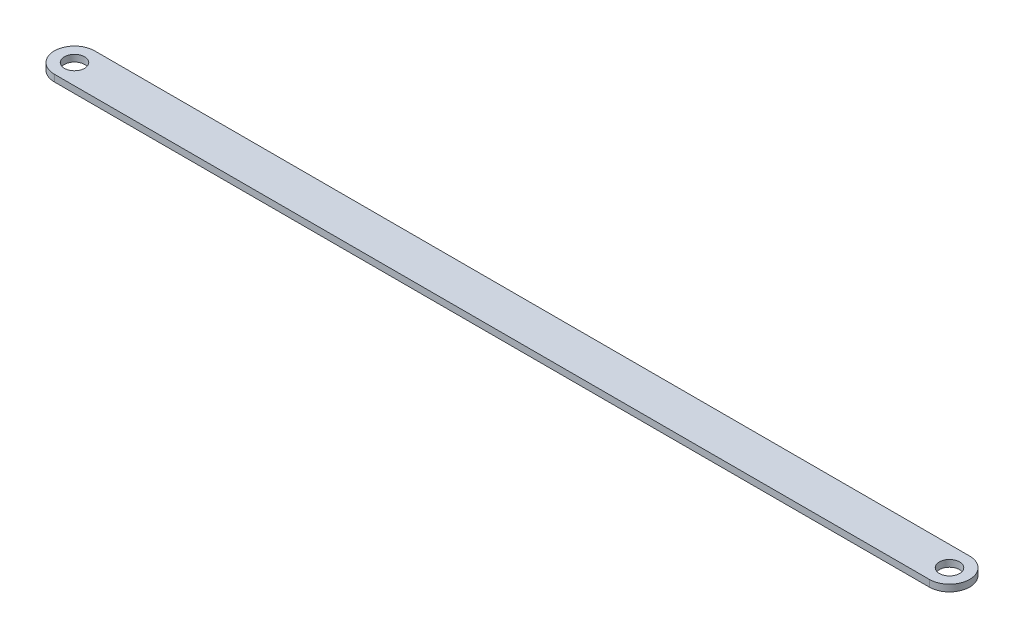
ISO-10303-21;
HEADER;
FILE_DESCRIPTION(('STEP AP214'),'2;1');
FILE_NAME('part.step','',(''),(''),'','','');
FILE_SCHEMA(('AUTOMOTIVE_DESIGN { 1 0 10303 214 1 1 1 1 }'));
ENDSEC;
DATA;
#1=APPLICATION_CONTEXT('core data for automotive mechanical design processes');
#2=APPLICATION_PROTOCOL_DEFINITION('international standard','automotive_design',2000,#1);
#3=PRODUCT_CONTEXT('',#1,'mechanical');
#4=PRODUCT('Part','Part','',(#3));
#5=PRODUCT_RELATED_PRODUCT_CATEGORY('part','',(#4));
#6=PRODUCT_DEFINITION_FORMATION('','',#4);
#7=PRODUCT_DEFINITION_CONTEXT('part definition',#1,'design');
#8=PRODUCT_DEFINITION('design','',#6,#7);
#9=PRODUCT_DEFINITION_SHAPE('','',#8);
#10=(LENGTH_UNIT() NAMED_UNIT(*) SI_UNIT(.MILLI.,.METRE.));
#11=(NAMED_UNIT(*) PLANE_ANGLE_UNIT() SI_UNIT($,.RADIAN.));
#12=(NAMED_UNIT(*) SI_UNIT($,.STERADIAN.) SOLID_ANGLE_UNIT());
#13=UNCERTAINTY_MEASURE_WITH_UNIT(LENGTH_MEASURE(1.E-05),#10,'distance_accuracy_value','');
#14=(GEOMETRIC_REPRESENTATION_CONTEXT(3) GLOBAL_UNCERTAINTY_ASSIGNED_CONTEXT((#13)) GLOBAL_UNIT_ASSIGNED_CONTEXT((#10,
#11,#12)) REPRESENTATION_CONTEXT('',''));
#15=CARTESIAN_POINT('',(0.,0.,0.));
#16=DIRECTION('',(0.,0.,1.));
#17=DIRECTION('',(1.,0.,0.));
#18=AXIS2_PLACEMENT_3D('',#15,#16,#17);
#19=CARTESIAN_POINT('',(65.,1.,0.));
#20=DIRECTION('',(0.,1.,0.));
#21=DIRECTION('',(0.,0.,1.));
#22=AXIS2_PLACEMENT_3D('',#19,#20,#21);
#23=PLANE('',#22);
#24=CARTESIAN_POINT('',(-65.,1.,0.));
#25=DIRECTION('',(0.,1.,0.));
#26=DIRECTION('',(0.,0.,1.));
#27=AXIS2_PLACEMENT_3D('',#24,#25,#26);
#28=CIRCLE('',#27,1.5);
#29=CARTESIAN_POINT('',(-65.,1.,1.5));
#30=VERTEX_POINT('',#29);
#31=EDGE_CURVE('E99',#30,#30,#28,.T.);
#32=ORIENTED_EDGE('',*,*,#31,.F.);
#33=EDGE_LOOP('',(#32));
#34=FACE_BOUND('',#33,.T.);
#35=CARTESIAN_POINT('',(65.,1.,0.));
#36=DIRECTION('',(0.,1.,0.));
#37=DIRECTION('',(0.,0.,1.));
#38=AXIS2_PLACEMENT_3D('',#35,#36,#37);
#39=CIRCLE('',#38,2.99999999999998);
#40=CARTESIAN_POINT('',(65.,1.,2.99999999999995));
#41=VERTEX_POINT('',#40);
#42=CARTESIAN_POINT('',(65.,1.,-3.));
#43=VERTEX_POINT('',#42);
#44=EDGE_CURVE('E84',#41,#43,#39,.T.);
#45=ORIENTED_EDGE('',*,*,#44,.T.);
#46=DIRECTION('',(-1.,0.,0.));
#47=VECTOR('',#46,1.);
#48=CARTESIAN_POINT('',(65.,1.,-3.));
#49=LINE('',#48,#47);
#50=CARTESIAN_POINT('',(-65.,1.,-2.99999999999998));
#51=VERTEX_POINT('',#50);
#52=EDGE_CURVE('E79',#43,#51,#49,.T.);
#53=ORIENTED_EDGE('',*,*,#52,.T.);
#54=CARTESIAN_POINT('',(-65.,1.,0.));
#55=DIRECTION('',(0.,1.,0.));
#56=DIRECTION('',(0.,0.,1.));
#57=AXIS2_PLACEMENT_3D('',#54,#55,#56);
#58=CIRCLE('',#57,2.99999999999998);
#59=CARTESIAN_POINT('',(-65.,1.,2.99999999999999));
#60=VERTEX_POINT('',#59);
#61=EDGE_CURVE('E82',#51,#60,#58,.T.);
#62=ORIENTED_EDGE('',*,*,#61,.T.);
#63=DIRECTION('',(1.,0.,0.));
#64=VECTOR('',#63,1.);
#65=CARTESIAN_POINT('',(65.,1.,2.99999999999995));
#66=LINE('',#65,#64);
#67=EDGE_CURVE('E49',#60,#41,#66,.T.);
#68=ORIENTED_EDGE('',*,*,#67,.T.);
#69=EDGE_LOOP('',(#45,#53,#62,#68));
#70=FACE_BOUND('',#69,.T.);
#71=CARTESIAN_POINT('',(65.,1.,0.));
#72=DIRECTION('',(0.,1.,0.));
#73=DIRECTION('',(0.,0.,1.));
#74=AXIS2_PLACEMENT_3D('',#71,#72,#73);
#75=CIRCLE('',#74,1.5);
#76=CARTESIAN_POINT('',(65.,1.,1.5));
#77=VERTEX_POINT('',#76);
#78=EDGE_CURVE('E114',#77,#77,#75,.T.);
#79=ORIENTED_EDGE('',*,*,#78,.F.);
#80=EDGE_LOOP('',(#79));
#81=FACE_BOUND('',#80,.T.);
#82=ADVANCED_FACE('F32',(#34,#70,#81),#23,.T.);
#83=CARTESIAN_POINT('',(65.,0.,0.));
#84=DIRECTION('',(0.,1.,0.));
#85=DIRECTION('',(0.,0.,1.));
#86=AXIS2_PLACEMENT_3D('',#83,#84,#85);
#87=PLANE('',#86);
#88=CARTESIAN_POINT('',(65.,0.,0.));
#89=DIRECTION('',(0.,1.,0.));
#90=DIRECTION('',(0.,0.,1.));
#91=AXIS2_PLACEMENT_3D('',#88,#89,#90);
#92=CIRCLE('',#91,2.99999999999998);
#93=CARTESIAN_POINT('',(65.,0.,2.99999999999995));
#94=VERTEX_POINT('',#93);
#95=CARTESIAN_POINT('',(65.,0.,-3.));
#96=VERTEX_POINT('',#95);
#97=EDGE_CURVE('E96',#94,#96,#92,.T.);
#98=ORIENTED_EDGE('',*,*,#97,.F.);
#99=DIRECTION('',(1.,0.,0.));
#100=VECTOR('',#99,1.);
#101=CARTESIAN_POINT('',(65.,0.,2.99999999999995));
#102=LINE('',#101,#100);
#103=CARTESIAN_POINT('',(-65.,0.,2.99999999999999));
#104=VERTEX_POINT('',#103);
#105=EDGE_CURVE('E72',#104,#94,#102,.T.);
#106=ORIENTED_EDGE('',*,*,#105,.F.);
#107=CARTESIAN_POINT('',(-65.,0.,0.));
#108=DIRECTION('',(0.,1.,0.));
#109=DIRECTION('',(0.,0.,1.));
#110=AXIS2_PLACEMENT_3D('',#107,#108,#109);
#111=CIRCLE('',#110,2.99999999999998);
#112=CARTESIAN_POINT('',(-65.,0.,-2.99999999999998));
#113=VERTEX_POINT('',#112);
#114=EDGE_CURVE('E66',#113,#104,#111,.T.);
#115=ORIENTED_EDGE('',*,*,#114,.F.);
#116=DIRECTION('',(-1.,0.,0.));
#117=VECTOR('',#116,1.);
#118=CARTESIAN_POINT('',(65.,0.,-3.));
#119=LINE('',#118,#117);
#120=EDGE_CURVE('E88',#96,#113,#119,.T.);
#121=ORIENTED_EDGE('',*,*,#120,.F.);
#122=EDGE_LOOP('',(#98,#106,#115,#121));
#123=FACE_BOUND('',#122,.T.);
#124=CARTESIAN_POINT('',(-65.,0.,0.));
#125=DIRECTION('',(0.,1.,0.));
#126=DIRECTION('',(0.,0.,1.));
#127=AXIS2_PLACEMENT_3D('',#124,#125,#126);
#128=CIRCLE('',#127,1.5);
#129=CARTESIAN_POINT('',(-65.,0.,1.5));
#130=VERTEX_POINT('',#129);
#131=EDGE_CURVE('E111',#130,#130,#128,.T.);
#132=ORIENTED_EDGE('',*,*,#131,.T.);
#133=EDGE_LOOP('',(#132));
#134=FACE_BOUND('',#133,.T.);
#135=CARTESIAN_POINT('',(65.,0.,0.));
#136=DIRECTION('',(0.,1.,0.));
#137=DIRECTION('',(0.,0.,1.));
#138=AXIS2_PLACEMENT_3D('',#135,#136,#137);
#139=CIRCLE('',#138,1.5);
#140=CARTESIAN_POINT('',(65.,0.,1.5));
#141=VERTEX_POINT('',#140);
#142=EDGE_CURVE('E117',#141,#141,#139,.T.);
#143=ORIENTED_EDGE('',*,*,#142,.T.);
#144=EDGE_LOOP('',(#143));
#145=FACE_BOUND('',#144,.T.);
#146=ADVANCED_FACE('F107',(#123,#134,#145),#87,.F.);
#147=CARTESIAN_POINT('',(65.,1.,0.));
#148=DIRECTION('',(0.,-1.,0.));
#149=DIRECTION('',(0.,0.,-1.));
#150=AXIS2_PLACEMENT_3D('',#147,#148,#149);
#151=CYLINDRICAL_SURFACE('',#150,2.99999999999998);
#152=ORIENTED_EDGE('',*,*,#97,.T.);
#153=DIRECTION('',(0.,-1.,0.));
#154=VECTOR('',#153,1.);
#155=CARTESIAN_POINT('',(65.,1.,-3.));
#156=LINE('',#155,#154);
#157=EDGE_CURVE('E11',#43,#96,#156,.T.);
#158=ORIENTED_EDGE('',*,*,#157,.F.);
#159=ORIENTED_EDGE('',*,*,#44,.F.);
#160=DIRECTION('',(0.,-1.,0.));
#161=VECTOR('',#160,1.);
#162=CARTESIAN_POINT('',(65.,1.,2.99999999999995));
#163=LINE('',#162,#161);
#164=EDGE_CURVE('E92',#41,#94,#163,.T.);
#165=ORIENTED_EDGE('',*,*,#164,.T.);
#166=EDGE_LOOP('',(#152,#158,#159,#165));
#167=FACE_BOUND('',#166,.T.);
#168=ADVANCED_FACE('F34',(#167),#151,.T.);
#169=CARTESIAN_POINT('',(65.,1.,-3.));
#170=DIRECTION('',(0.,0.,1.));
#171=DIRECTION('',(1.,0.,0.));
#172=AXIS2_PLACEMENT_3D('',#169,#170,#171);
#173=PLANE('',#172);
#174=ORIENTED_EDGE('',*,*,#120,.T.);
#175=DIRECTION('',(0.,-1.,0.));
#176=VECTOR('',#175,1.);
#177=CARTESIAN_POINT('',(-65.,1.,-2.99999999999998));
#178=LINE('',#177,#176);
#179=EDGE_CURVE('E41',#51,#113,#178,.T.);
#180=ORIENTED_EDGE('',*,*,#179,.F.);
#181=ORIENTED_EDGE('',*,*,#52,.F.);
#182=ORIENTED_EDGE('',*,*,#157,.T.);
#183=EDGE_LOOP('',(#174,#180,#181,#182));
#184=FACE_BOUND('',#183,.T.);
#185=ADVANCED_FACE('F87',(#184),#173,.F.);
#186=CARTESIAN_POINT('',(-65.,1.,0.));
#187=DIRECTION('',(0.,-1.,0.));
#188=DIRECTION('',(0.,0.,-1.));
#189=AXIS2_PLACEMENT_3D('',#186,#187,#188);
#190=CYLINDRICAL_SURFACE('',#189,2.99999999999998);
#191=ORIENTED_EDGE('',*,*,#114,.T.);
#192=DIRECTION('',(0.,-1.,0.));
#193=VECTOR('',#192,1.);
#194=CARTESIAN_POINT('',(-65.,1.,2.99999999999999));
#195=LINE('',#194,#193);
#196=EDGE_CURVE('E89',#60,#104,#195,.T.);
#197=ORIENTED_EDGE('',*,*,#196,.F.);
#198=ORIENTED_EDGE('',*,*,#61,.F.);
#199=ORIENTED_EDGE('',*,*,#179,.T.);
#200=EDGE_LOOP('',(#191,#197,#198,#199));
#201=FACE_BOUND('',#200,.T.);
#202=ADVANCED_FACE('F90',(#201),#190,.T.);
#203=CARTESIAN_POINT('',(65.,1.,2.99999999999995));
#204=DIRECTION('',(0.,0.,-1.));
#205=DIRECTION('',(-1.,0.,0.));
#206=AXIS2_PLACEMENT_3D('',#203,#204,#205);
#207=PLANE('',#206);
#208=ORIENTED_EDGE('',*,*,#105,.T.);
#209=ORIENTED_EDGE('',*,*,#164,.F.);
#210=ORIENTED_EDGE('',*,*,#67,.F.);
#211=ORIENTED_EDGE('',*,*,#196,.T.);
#212=EDGE_LOOP('',(#208,#209,#210,#211));
#213=FACE_BOUND('',#212,.T.);
#214=ADVANCED_FACE('F104',(#213),#207,.F.);
#215=CARTESIAN_POINT('',(-65.,1.,0.));
#216=DIRECTION('',(0.,-1.,0.));
#217=DIRECTION('',(0.,0.,-1.));
#218=AXIS2_PLACEMENT_3D('',#215,#216,#217);
#219=CYLINDRICAL_SURFACE('',#218,1.5);
#220=ORIENTED_EDGE('',*,*,#31,.T.);
#221=EDGE_LOOP('',(#220));
#222=FACE_BOUND('',#221,.T.);
#223=ORIENTED_EDGE('',*,*,#131,.F.);
#224=EDGE_LOOP('',(#223));
#225=FACE_BOUND('',#224,.T.);
#226=ADVANCED_FACE('F134',(#222,#225),#219,.F.);
#227=CARTESIAN_POINT('',(65.,1.,0.));
#228=DIRECTION('',(0.,-1.,0.));
#229=DIRECTION('',(0.,0.,-1.));
#230=AXIS2_PLACEMENT_3D('',#227,#228,#229);
#231=CYLINDRICAL_SURFACE('',#230,1.5);
#232=ORIENTED_EDGE('',*,*,#78,.T.);
#233=EDGE_LOOP('',(#232));
#234=FACE_BOUND('',#233,.T.);
#235=ORIENTED_EDGE('',*,*,#142,.F.);
#236=EDGE_LOOP('',(#235));
#237=FACE_BOUND('',#236,.T.);
#238=ADVANCED_FACE('F123',(#234,#237),#231,.F.);
#239=CLOSED_SHELL('',(#82,#146,#168,#185,#202,#214,#226,#238));
#240=MANIFOLD_SOLID_BREP('B2',#239);
#241=ADVANCED_BREP_SHAPE_REPRESENTATION('',(#18,#240),#14);
#242=SHAPE_DEFINITION_REPRESENTATION(#9,#241);
ENDSEC;
END-ISO-10303-21;
